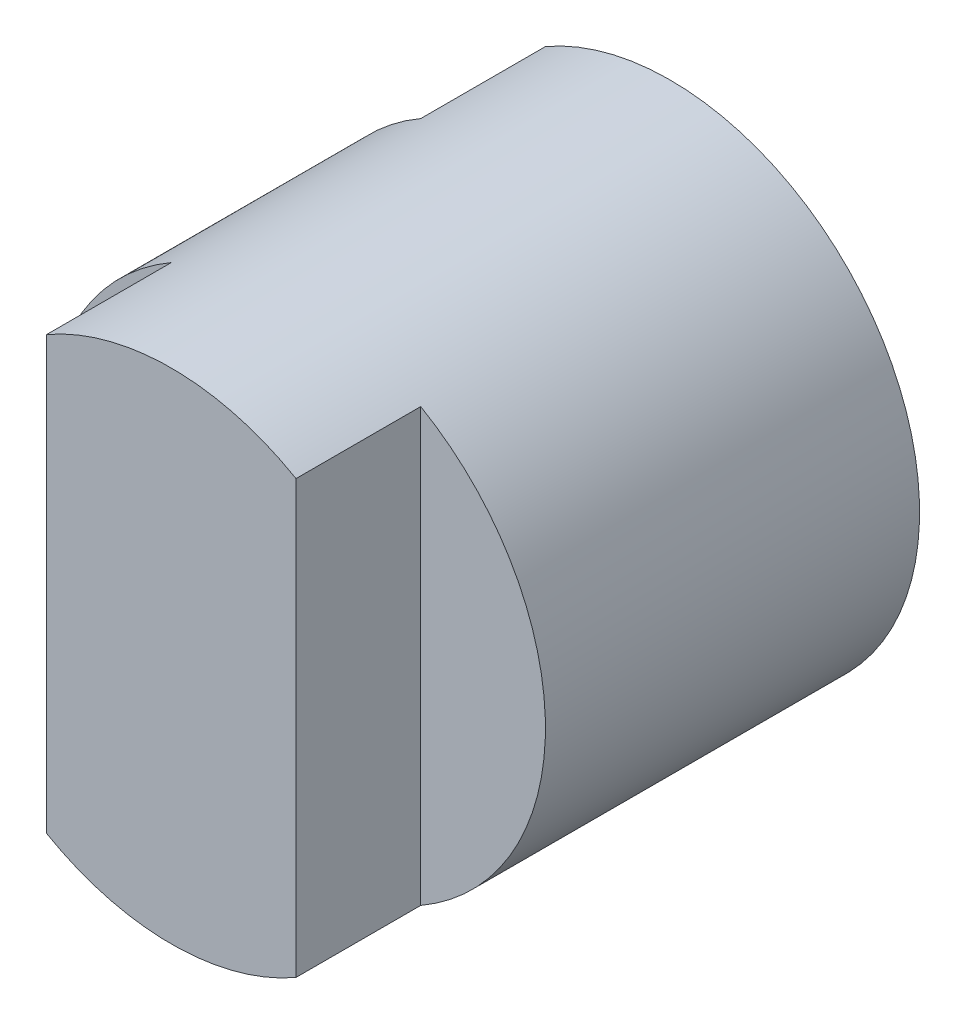
ISO-10303-21;
HEADER;
FILE_DESCRIPTION(('STEP AP214'),'2;1');
FILE_NAME('part.step','',(''),(''),'','','');
FILE_SCHEMA(('AUTOMOTIVE_DESIGN { 1 0 10303 214 1 1 1 1 }'));
ENDSEC;
DATA;
#1=APPLICATION_CONTEXT('core data for automotive mechanical design processes');
#2=APPLICATION_PROTOCOL_DEFINITION('international standard','automotive_design',2000,#1);
#3=PRODUCT_CONTEXT('',#1,'mechanical');
#4=PRODUCT('Part','Part','',(#3));
#5=PRODUCT_RELATED_PRODUCT_CATEGORY('part','',(#4));
#6=PRODUCT_DEFINITION_FORMATION('','',#4);
#7=PRODUCT_DEFINITION_CONTEXT('part definition',#1,'design');
#8=PRODUCT_DEFINITION('design','',#6,#7);
#9=PRODUCT_DEFINITION_SHAPE('','',#8);
#10=(LENGTH_UNIT() NAMED_UNIT(*) SI_UNIT(.MILLI.,.METRE.));
#11=(NAMED_UNIT(*) PLANE_ANGLE_UNIT() SI_UNIT($,.RADIAN.));
#12=(NAMED_UNIT(*) SI_UNIT($,.STERADIAN.) SOLID_ANGLE_UNIT());
#13=UNCERTAINTY_MEASURE_WITH_UNIT(LENGTH_MEASURE(1.E-05),#10,'distance_accuracy_value','');
#14=(GEOMETRIC_REPRESENTATION_CONTEXT(3) GLOBAL_UNCERTAINTY_ASSIGNED_CONTEXT((#13)) GLOBAL_UNIT_ASSIGNED_CONTEXT((#10,
#11,#12)) REPRESENTATION_CONTEXT('',''));
#15=CARTESIAN_POINT('',(0.,0.,0.));
#16=DIRECTION('',(0.,0.,1.));
#17=DIRECTION('',(1.,0.,0.));
#18=AXIS2_PLACEMENT_3D('',#15,#16,#17);
#19=CARTESIAN_POINT('',(0.,0.,4.));
#20=DIRECTION('',(0.,0.,-1.));
#21=DIRECTION('',(-1.,0.,0.));
#22=AXIS2_PLACEMENT_3D('',#19,#20,#21);
#23=CYLINDRICAL_SURFACE('',#22,2.);
#24=CARTESIAN_POINT('',(0.,0.,4.));
#25=DIRECTION('',(0.,0.,1.));
#26=DIRECTION('',(1.,0.,0.));
#27=AXIS2_PLACEMENT_3D('',#24,#25,#26);
#28=CIRCLE('',#27,2.);
#29=CARTESIAN_POINT('',(-1.,-1.73205080756888,4.));
#30=VERTEX_POINT('',#29);
#31=CARTESIAN_POINT('',(1.,-1.73205080756888,4.));
#32=VERTEX_POINT('',#31);
#33=EDGE_CURVE('E120',#30,#32,#28,.T.);
#34=ORIENTED_EDGE('',*,*,#33,.F.);
#35=DIRECTION('',(0.,0.,-1.));
#36=VECTOR('',#35,1.);
#37=CARTESIAN_POINT('',(-1.,-1.73205080756888,4.));
#38=LINE('',#37,#36);
#39=CARTESIAN_POINT('',(-1.,-1.73205080756888,3.));
#40=VERTEX_POINT('',#39);
#41=EDGE_CURVE('E47',#30,#40,#38,.T.);
#42=ORIENTED_EDGE('',*,*,#41,.T.);
#43=CARTESIAN_POINT('',(0.,0.,3.));
#44=DIRECTION('',(0.,0.,-1.));
#45=DIRECTION('',(-1.,0.,0.));
#46=AXIS2_PLACEMENT_3D('',#43,#44,#45);
#47=CIRCLE('',#46,2.);
#48=CARTESIAN_POINT('',(-1.,1.73205080756888,3.));
#49=VERTEX_POINT('',#48);
#50=EDGE_CURVE('E40',#40,#49,#47,.T.);
#51=ORIENTED_EDGE('',*,*,#50,.T.);
#52=DIRECTION('',(0.,0.,-1.));
#53=VECTOR('',#52,1.);
#54=CARTESIAN_POINT('',(-1.,1.73205080756888,4.));
#55=LINE('',#54,#53);
#56=CARTESIAN_POINT('',(-1.,1.73205080756888,4.));
#57=VERTEX_POINT('',#56);
#58=EDGE_CURVE('E113',#49,#57,#55,.F.);
#59=ORIENTED_EDGE('',*,*,#58,.T.);
#60=CARTESIAN_POINT('',(1.,1.73205080756888,4.));
#61=VERTEX_POINT('',#60);
#62=EDGE_CURVE('E117',#61,#57,#28,.T.);
#63=ORIENTED_EDGE('',*,*,#62,.F.);
#64=DIRECTION('',(0.,0.,-1.));
#65=VECTOR('',#64,1.);
#66=CARTESIAN_POINT('',(1.,1.73205080756888,4.));
#67=LINE('',#66,#65);
#68=CARTESIAN_POINT('',(1.,1.73205080756888,3.));
#69=VERTEX_POINT('',#68);
#70=EDGE_CURVE('E55',#61,#69,#67,.T.);
#71=ORIENTED_EDGE('',*,*,#70,.T.);
#72=CARTESIAN_POINT('',(0.,0.,3.));
#73=DIRECTION('',(0.,0.,-1.));
#74=DIRECTION('',(-1.,0.,0.));
#75=AXIS2_PLACEMENT_3D('',#72,#73,#74);
#76=CIRCLE('',#75,2.);
#77=CARTESIAN_POINT('',(1.,-1.73205080756888,3.));
#78=VERTEX_POINT('',#77);
#79=EDGE_CURVE('E127',#69,#78,#76,.T.);
#80=ORIENTED_EDGE('',*,*,#79,.T.);
#81=DIRECTION('',(0.,0.,-1.));
#82=VECTOR('',#81,1.);
#83=CARTESIAN_POINT('',(1.,-1.73205080756888,4.));
#84=LINE('',#83,#82);
#85=EDGE_CURVE('E97',#78,#32,#84,.F.);
#86=ORIENTED_EDGE('',*,*,#85,.T.);
#87=EDGE_LOOP('',(#34,#42,#51,#59,#63,#71,#80,#86));
#88=FACE_BOUND('',#87,.T.);
#89=CARTESIAN_POINT('',(0.,0.,1.));
#90=DIRECTION('',(0.,0.,1.));
#91=DIRECTION('',(1.,0.,0.));
#92=AXIS2_PLACEMENT_3D('',#89,#90,#91);
#93=CIRCLE('',#92,2.);
#94=CARTESIAN_POINT('',(-1.,1.73205080756888,1.));
#95=VERTEX_POINT('',#94);
#96=CARTESIAN_POINT('',(-1.,-1.73205080756888,1.));
#97=VERTEX_POINT('',#96);
#98=EDGE_CURVE('E11',#95,#97,#93,.T.);
#99=ORIENTED_EDGE('',*,*,#98,.T.);
#100=DIRECTION('',(0.,0.,-1.));
#101=VECTOR('',#100,1.);
#102=CARTESIAN_POINT('',(-1.,-1.73205080756888,4.));
#103=LINE('',#102,#101);
#104=CARTESIAN_POINT('',(-1.,-1.73205080756888,0.));
#105=VERTEX_POINT('',#104);
#106=EDGE_CURVE('E87',#97,#105,#103,.T.);
#107=ORIENTED_EDGE('',*,*,#106,.T.);
#108=CARTESIAN_POINT('',(0.,0.,0.));
#109=DIRECTION('',(0.,0.,1.));
#110=DIRECTION('',(1.,0.,0.));
#111=AXIS2_PLACEMENT_3D('',#108,#109,#110);
#112=CIRCLE('',#111,2.);
#113=CARTESIAN_POINT('',(-1.,1.73205080756888,0.));
#114=VERTEX_POINT('',#113);
#115=EDGE_CURVE('E104',#105,#114,#112,.T.);
#116=ORIENTED_EDGE('',*,*,#115,.T.);
#117=DIRECTION('',(0.,0.,-1.));
#118=VECTOR('',#117,1.);
#119=CARTESIAN_POINT('',(-1.,1.73205080756888,4.));
#120=LINE('',#119,#118);
#121=EDGE_CURVE('E98',#114,#95,#120,.F.);
#122=ORIENTED_EDGE('',*,*,#121,.T.);
#123=EDGE_LOOP('',(#99,#107,#116,#122));
#124=FACE_BOUND('',#123,.T.);
#125=ADVANCED_FACE('F33',(#88,#124),#23,.T.);
#126=CARTESIAN_POINT('',(0.,0.,4.));
#127=DIRECTION('',(0.,0.,1.));
#128=DIRECTION('',(1.,0.,0.));
#129=AXIS2_PLACEMENT_3D('',#126,#127,#128);
#130=PLANE('',#129);
#131=DIRECTION('',(0.,1.,0.));
#132=VECTOR('',#131,1.);
#133=CARTESIAN_POINT('',(-1.,0.,4.));
#134=LINE('',#133,#132);
#135=EDGE_CURVE('E125',#30,#57,#134,.T.);
#136=ORIENTED_EDGE('',*,*,#135,.F.);
#137=ORIENTED_EDGE('',*,*,#33,.T.);
#138=DIRECTION('',(0.,-1.,0.));
#139=VECTOR('',#138,1.);
#140=CARTESIAN_POINT('',(1.,0.,4.));
#141=LINE('',#140,#139);
#142=EDGE_CURVE('E123',#61,#32,#141,.T.);
#143=ORIENTED_EDGE('',*,*,#142,.F.);
#144=ORIENTED_EDGE('',*,*,#62,.T.);
#145=EDGE_LOOP('',(#136,#137,#143,#144));
#146=FACE_BOUND('',#145,.T.);
#147=ADVANCED_FACE('F141',(#146),#130,.T.);
#148=CARTESIAN_POINT('',(0.,0.,0.));
#149=DIRECTION('',(0.,0.,1.));
#150=DIRECTION('',(1.,0.,0.));
#151=AXIS2_PLACEMENT_3D('',#148,#149,#150);
#152=PLANE('',#151);
#153=ORIENTED_EDGE('',*,*,#115,.F.);
#154=DIRECTION('',(0.,1.,0.));
#155=VECTOR('',#154,1.);
#156=CARTESIAN_POINT('',(-1.,0.,0.));
#157=LINE('',#156,#155);
#158=EDGE_CURVE('E93',#105,#114,#157,.T.);
#159=ORIENTED_EDGE('',*,*,#158,.T.);
#160=EDGE_LOOP('',(#153,#159));
#161=FACE_BOUND('',#160,.T.);
#162=ADVANCED_FACE('F144',(#161),#152,.F.);
#163=CARTESIAN_POINT('',(-1.,-5.,1.));
#164=DIRECTION('',(1.,0.,0.));
#165=DIRECTION('',(0.,0.,-1.));
#166=AXIS2_PLACEMENT_3D('',#163,#164,#165);
#167=PLANE('',#166);
#168=DIRECTION('',(0.,1.,0.));
#169=VECTOR('',#168,1.);
#170=CARTESIAN_POINT('',(-1.,-5.,1.));
#171=LINE('',#170,#169);
#172=EDGE_CURVE('E90',#97,#95,#171,.T.);
#173=ORIENTED_EDGE('',*,*,#172,.T.);
#174=ORIENTED_EDGE('',*,*,#121,.F.);
#175=ORIENTED_EDGE('',*,*,#158,.F.);
#176=ORIENTED_EDGE('',*,*,#106,.F.);
#177=EDGE_LOOP('',(#173,#174,#175,#176));
#178=FACE_BOUND('',#177,.T.);
#179=ADVANCED_FACE('F89',(#178),#167,.F.);
#180=CARTESIAN_POINT('',(-2.31386891999832,-5.,1.));
#181=DIRECTION('',(0.,0.,1.));
#182=DIRECTION('',(1.,0.,0.));
#183=AXIS2_PLACEMENT_3D('',#180,#181,#182);
#184=PLANE('',#183);
#185=ORIENTED_EDGE('',*,*,#172,.F.);
#186=ORIENTED_EDGE('',*,*,#98,.F.);
#187=EDGE_LOOP('',(#185,#186));
#188=FACE_BOUND('',#187,.T.);
#189=ADVANCED_FACE('F101',(#188),#184,.F.);
#190=CARTESIAN_POINT('',(1.,-5.,3.));
#191=DIRECTION('',(-1.,0.,0.));
#192=DIRECTION('',(0.,0.,1.));
#193=AXIS2_PLACEMENT_3D('',#190,#191,#192);
#194=PLANE('',#193);
#195=ORIENTED_EDGE('',*,*,#142,.T.);
#196=ORIENTED_EDGE('',*,*,#85,.F.);
#197=DIRECTION('',(0.,1.,0.));
#198=VECTOR('',#197,1.);
#199=CARTESIAN_POINT('',(1.,-5.,3.));
#200=LINE('',#199,#198);
#201=EDGE_CURVE('E107',#78,#69,#200,.T.);
#202=ORIENTED_EDGE('',*,*,#201,.T.);
#203=ORIENTED_EDGE('',*,*,#70,.F.);
#204=EDGE_LOOP('',(#195,#196,#202,#203));
#205=FACE_BOUND('',#204,.T.);
#206=ADVANCED_FACE('F138',(#205),#194,.F.);
#207=CARTESIAN_POINT('',(2.,-5.,3.));
#208=DIRECTION('',(0.,0.,-1.));
#209=DIRECTION('',(-1.,0.,0.));
#210=AXIS2_PLACEMENT_3D('',#207,#208,#209);
#211=PLANE('',#210);
#212=ORIENTED_EDGE('',*,*,#201,.F.);
#213=ORIENTED_EDGE('',*,*,#79,.F.);
#214=EDGE_LOOP('',(#212,#213));
#215=FACE_BOUND('',#214,.T.);
#216=ADVANCED_FACE('F152',(#215),#211,.F.);
#217=CARTESIAN_POINT('',(-1.,-5.,3.));
#218=DIRECTION('',(0.,0.,-1.));
#219=DIRECTION('',(-1.,0.,0.));
#220=AXIS2_PLACEMENT_3D('',#217,#218,#219);
#221=PLANE('',#220);
#222=DIRECTION('',(0.,1.,0.));
#223=VECTOR('',#222,1.);
#224=CARTESIAN_POINT('',(-1.,-5.,3.));
#225=LINE('',#224,#223);
#226=EDGE_CURVE('E102',#40,#49,#225,.T.);
#227=ORIENTED_EDGE('',*,*,#226,.T.);
#228=ORIENTED_EDGE('',*,*,#50,.F.);
#229=EDGE_LOOP('',(#227,#228));
#230=FACE_BOUND('',#229,.T.);
#231=ADVANCED_FACE('F135',(#230),#221,.F.);
#232=CARTESIAN_POINT('',(-1.,-5.,4.26455627023164));
#233=DIRECTION('',(1.,0.,0.));
#234=DIRECTION('',(0.,0.,-1.));
#235=AXIS2_PLACEMENT_3D('',#232,#233,#234);
#236=PLANE('',#235);
#237=ORIENTED_EDGE('',*,*,#135,.T.);
#238=ORIENTED_EDGE('',*,*,#58,.F.);
#239=ORIENTED_EDGE('',*,*,#226,.F.);
#240=ORIENTED_EDGE('',*,*,#41,.F.);
#241=EDGE_LOOP('',(#237,#238,#239,#240));
#242=FACE_BOUND('',#241,.T.);
#243=ADVANCED_FACE('F136',(#242),#236,.F.);
#244=CLOSED_SHELL('',(#125,#147,#162,#179,#189,#206,#216,#231,#243));
#245=MANIFOLD_SOLID_BREP('B2',#244);
#246=ADVANCED_BREP_SHAPE_REPRESENTATION('',(#18,#245),#14);
#247=SHAPE_DEFINITION_REPRESENTATION(#9,#246);
ENDSEC;
END-ISO-10303-21;
